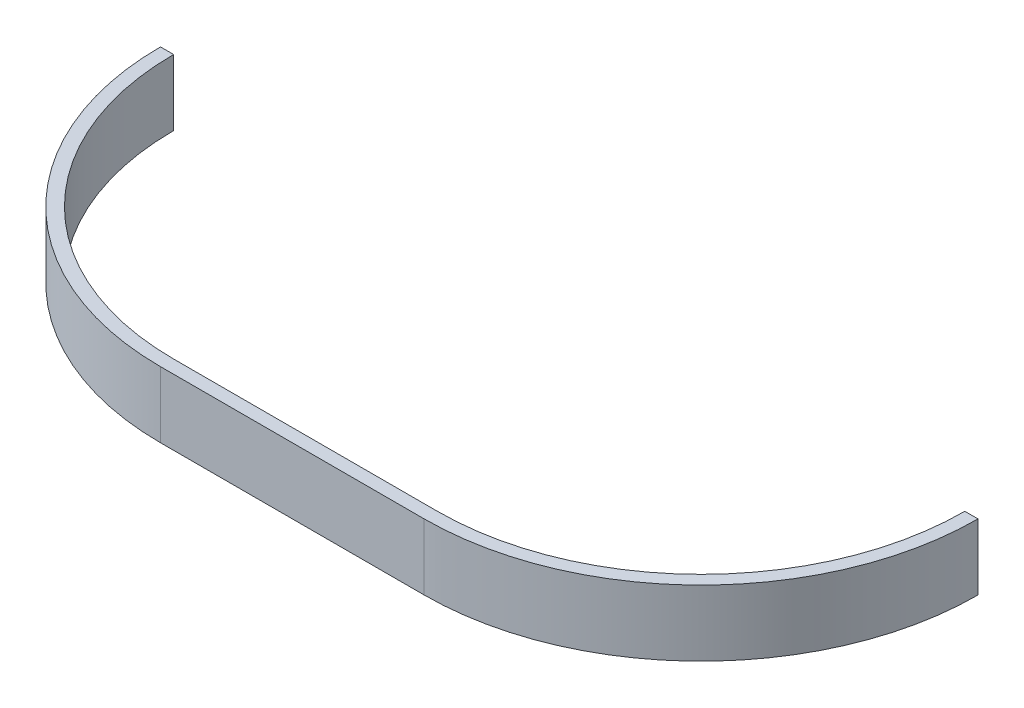
ISO-10303-21;
HEADER;
FILE_DESCRIPTION(('STEP AP214'),'2;1');
FILE_NAME('part.step','',(''),(''),'','','');
FILE_SCHEMA(('AUTOMOTIVE_DESIGN { 1 0 10303 214 1 1 1 1 }'));
ENDSEC;
DATA;
#1=APPLICATION_CONTEXT('core data for automotive mechanical design processes');
#2=APPLICATION_PROTOCOL_DEFINITION('international standard','automotive_design',2000,#1);
#3=PRODUCT_CONTEXT('',#1,'mechanical');
#4=PRODUCT('Part','Part','',(#3));
#5=PRODUCT_RELATED_PRODUCT_CATEGORY('part','',(#4));
#6=PRODUCT_DEFINITION_FORMATION('','',#4);
#7=PRODUCT_DEFINITION_CONTEXT('part definition',#1,'design');
#8=PRODUCT_DEFINITION('design','',#6,#7);
#9=PRODUCT_DEFINITION_SHAPE('','',#8);
#10=(LENGTH_UNIT() NAMED_UNIT(*) SI_UNIT(.MILLI.,.METRE.));
#11=(NAMED_UNIT(*) PLANE_ANGLE_UNIT() SI_UNIT($,.RADIAN.));
#12=(NAMED_UNIT(*) SI_UNIT($,.STERADIAN.) SOLID_ANGLE_UNIT());
#13=UNCERTAINTY_MEASURE_WITH_UNIT(LENGTH_MEASURE(1.E-05),#10,'distance_accuracy_value','');
#14=(GEOMETRIC_REPRESENTATION_CONTEXT(3) GLOBAL_UNCERTAINTY_ASSIGNED_CONTEXT((#13)) GLOBAL_UNIT_ASSIGNED_CONTEXT((#10,
#11,#12)) REPRESENTATION_CONTEXT('',''));
#15=CARTESIAN_POINT('',(0.,0.,0.));
#16=DIRECTION('',(0.,0.,1.));
#17=DIRECTION('',(1.,0.,0.));
#18=AXIS2_PLACEMENT_3D('',#15,#16,#17);
#19=CARTESIAN_POINT('',(40.,20.,0.));
#20=DIRECTION('',(0.,-1.,0.));
#21=DIRECTION('',(0.,0.,-1.));
#22=AXIS2_PLACEMENT_3D('',#19,#20,#21);
#23=CYLINDRICAL_SURFACE('',#22,80.);
#24=CARTESIAN_POINT('',(40.,0.,0.));
#25=DIRECTION('',(0.,-1.,0.));
#26=DIRECTION('',(0.,0.,1.));
#27=AXIS2_PLACEMENT_3D('',#24,#25,#26);
#28=CIRCLE('',#27,80.);
#29=CARTESIAN_POINT('',(120.,0.,0.));
#30=VERTEX_POINT('',#29);
#31=CARTESIAN_POINT('',(40.,0.,80.));
#32=VERTEX_POINT('',#31);
#33=EDGE_CURVE('E132',#30,#32,#28,.T.);
#34=ORIENTED_EDGE('',*,*,#33,.T.);
#35=DIRECTION('',(0.,-1.,0.));
#36=VECTOR('',#35,1.);
#37=CARTESIAN_POINT('',(40.,20.,80.));
#38=LINE('',#37,#36);
#39=CARTESIAN_POINT('',(40.,20.,80.));
#40=VERTEX_POINT('',#39);
#41=EDGE_CURVE('E11',#40,#32,#38,.T.);
#42=ORIENTED_EDGE('',*,*,#41,.F.);
#43=CARTESIAN_POINT('',(40.,20.,0.));
#44=DIRECTION('',(0.,-1.,0.));
#45=DIRECTION('',(0.,0.,1.));
#46=AXIS2_PLACEMENT_3D('',#43,#44,#45);
#47=CIRCLE('',#46,80.);
#48=CARTESIAN_POINT('',(120.,20.,0.));
#49=VERTEX_POINT('',#48);
#50=EDGE_CURVE('E146',#49,#40,#47,.T.);
#51=ORIENTED_EDGE('',*,*,#50,.F.);
#52=DIRECTION('',(0.,-1.,0.));
#53=VECTOR('',#52,1.);
#54=CARTESIAN_POINT('',(120.,20.,0.));
#55=LINE('',#54,#53);
#56=EDGE_CURVE('E128',#49,#30,#55,.T.);
#57=ORIENTED_EDGE('',*,*,#56,.T.);
#58=EDGE_LOOP('',(#34,#42,#51,#57));
#59=FACE_BOUND('',#58,.T.);
#60=ADVANCED_FACE('F36',(#59),#23,.F.);
#61=CARTESIAN_POINT('',(-40.,20.,80.));
#62=DIRECTION('',(0.,0.,1.));
#63=DIRECTION('',(1.,0.,0.));
#64=AXIS2_PLACEMENT_3D('',#61,#62,#63);
#65=PLANE('',#64);
#66=DIRECTION('',(-1.,0.,0.));
#67=VECTOR('',#66,1.);
#68=CARTESIAN_POINT('',(-40.,0.,80.));
#69=LINE('',#68,#67);
#70=CARTESIAN_POINT('',(-40.,0.,80.));
#71=VERTEX_POINT('',#70);
#72=EDGE_CURVE('E135',#32,#71,#69,.T.);
#73=ORIENTED_EDGE('',*,*,#72,.T.);
#74=DIRECTION('',(0.,-1.,0.));
#75=VECTOR('',#74,1.);
#76=CARTESIAN_POINT('',(-40.,20.,80.));
#77=LINE('',#76,#75);
#78=CARTESIAN_POINT('',(-40.,20.,80.));
#79=VERTEX_POINT('',#78);
#80=EDGE_CURVE('E44',#79,#71,#77,.T.);
#81=ORIENTED_EDGE('',*,*,#80,.F.);
#82=DIRECTION('',(-1.,0.,0.));
#83=VECTOR('',#82,1.);
#84=CARTESIAN_POINT('',(-40.,20.,80.));
#85=LINE('',#84,#83);
#86=EDGE_CURVE('E95',#40,#79,#85,.T.);
#87=ORIENTED_EDGE('',*,*,#86,.F.);
#88=ORIENTED_EDGE('',*,*,#41,.T.);
#89=EDGE_LOOP('',(#73,#81,#87,#88));
#90=FACE_BOUND('',#89,.T.);
#91=ADVANCED_FACE('F181',(#90),#65,.F.);
#92=CARTESIAN_POINT('',(-40.,20.,0.));
#93=DIRECTION('',(0.,-1.,0.));
#94=DIRECTION('',(0.,0.,-1.));
#95=AXIS2_PLACEMENT_3D('',#92,#93,#94);
#96=CYLINDRICAL_SURFACE('',#95,80.);
#97=CARTESIAN_POINT('',(-40.,0.,0.));
#98=DIRECTION('',(0.,-1.,0.));
#99=DIRECTION('',(0.,0.,1.));
#100=AXIS2_PLACEMENT_3D('',#97,#98,#99);
#101=CIRCLE('',#100,80.);
#102=CARTESIAN_POINT('',(-120.,0.,0.));
#103=VERTEX_POINT('',#102);
#104=EDGE_CURVE('E137',#71,#103,#101,.T.);
#105=ORIENTED_EDGE('',*,*,#104,.T.);
#106=DIRECTION('',(0.,-1.,0.));
#107=VECTOR('',#106,1.);
#108=CARTESIAN_POINT('',(-120.,20.,0.));
#109=LINE('',#108,#107);
#110=CARTESIAN_POINT('',(-120.,20.,0.));
#111=VERTEX_POINT('',#110);
#112=EDGE_CURVE('E153',#111,#103,#109,.T.);
#113=ORIENTED_EDGE('',*,*,#112,.F.);
#114=CARTESIAN_POINT('',(-40.,20.,0.));
#115=DIRECTION('',(0.,-1.,0.));
#116=DIRECTION('',(0.,0.,1.));
#117=AXIS2_PLACEMENT_3D('',#114,#115,#116);
#118=CIRCLE('',#117,80.);
#119=EDGE_CURVE('E161',#79,#111,#118,.T.);
#120=ORIENTED_EDGE('',*,*,#119,.F.);
#121=ORIENTED_EDGE('',*,*,#80,.T.);
#122=EDGE_LOOP('',(#105,#113,#120,#121));
#123=FACE_BOUND('',#122,.T.);
#124=ADVANCED_FACE('F159',(#123),#96,.F.);
#125=CARTESIAN_POINT('',(-124.,20.,0.));
#126=DIRECTION('',(0.,0.,1.));
#127=DIRECTION('',(1.,0.,0.));
#128=AXIS2_PLACEMENT_3D('',#125,#126,#127);
#129=PLANE('',#128);
#130=DIRECTION('',(-1.,0.,0.));
#131=VECTOR('',#130,1.);
#132=CARTESIAN_POINT('',(-124.,0.,0.));
#133=LINE('',#132,#131);
#134=CARTESIAN_POINT('',(-124.,0.,0.));
#135=VERTEX_POINT('',#134);
#136=EDGE_CURVE('E139',#103,#135,#133,.T.);
#137=ORIENTED_EDGE('',*,*,#136,.T.);
#138=DIRECTION('',(0.,-1.,0.));
#139=VECTOR('',#138,1.);
#140=CARTESIAN_POINT('',(-124.,20.,0.));
#141=LINE('',#140,#139);
#142=CARTESIAN_POINT('',(-124.,20.,0.));
#143=VERTEX_POINT('',#142);
#144=EDGE_CURVE('E150',#143,#135,#141,.T.);
#145=ORIENTED_EDGE('',*,*,#144,.F.);
#146=DIRECTION('',(-1.,0.,0.));
#147=VECTOR('',#146,1.);
#148=CARTESIAN_POINT('',(-124.,20.,0.));
#149=LINE('',#148,#147);
#150=EDGE_CURVE('E173',#111,#143,#149,.T.);
#151=ORIENTED_EDGE('',*,*,#150,.F.);
#152=ORIENTED_EDGE('',*,*,#112,.T.);
#153=EDGE_LOOP('',(#137,#145,#151,#152));
#154=FACE_BOUND('',#153,.T.);
#155=ADVANCED_FACE('F169',(#154),#129,.F.);
#156=CARTESIAN_POINT('',(-40.,20.,0.));
#157=DIRECTION('',(0.,-1.,0.));
#158=DIRECTION('',(0.,0.,-1.));
#159=AXIS2_PLACEMENT_3D('',#156,#157,#158);
#160=CYLINDRICAL_SURFACE('',#159,84.);
#161=CARTESIAN_POINT('',(-40.,0.,0.));
#162=DIRECTION('',(0.,1.,0.));
#163=DIRECTION('',(0.,0.,1.));
#164=AXIS2_PLACEMENT_3D('',#161,#162,#163);
#165=CIRCLE('',#164,84.);
#166=CARTESIAN_POINT('',(-40.,0.,84.));
#167=VERTEX_POINT('',#166);
#168=EDGE_CURVE('E141',#135,#167,#165,.T.);
#169=ORIENTED_EDGE('',*,*,#168,.T.);
#170=DIRECTION('',(0.,-1.,0.));
#171=VECTOR('',#170,1.);
#172=CARTESIAN_POINT('',(-40.,20.,84.));
#173=LINE('',#172,#171);
#174=CARTESIAN_POINT('',(-40.,20.,84.));
#175=VERTEX_POINT('',#174);
#176=EDGE_CURVE('E123',#175,#167,#173,.T.);
#177=ORIENTED_EDGE('',*,*,#176,.F.);
#178=CARTESIAN_POINT('',(-40.,20.,0.));
#179=DIRECTION('',(0.,1.,0.));
#180=DIRECTION('',(0.,0.,1.));
#181=AXIS2_PLACEMENT_3D('',#178,#179,#180);
#182=CIRCLE('',#181,84.);
#183=EDGE_CURVE('E114',#143,#175,#182,.T.);
#184=ORIENTED_EDGE('',*,*,#183,.F.);
#185=ORIENTED_EDGE('',*,*,#144,.T.);
#186=EDGE_LOOP('',(#169,#177,#184,#185));
#187=FACE_BOUND('',#186,.T.);
#188=ADVANCED_FACE('F172',(#187),#160,.T.);
#189=CARTESIAN_POINT('',(-40.,20.,84.));
#190=DIRECTION('',(0.,0.,-1.));
#191=DIRECTION('',(-1.,0.,0.));
#192=AXIS2_PLACEMENT_3D('',#189,#190,#191);
#193=PLANE('',#192);
#194=DIRECTION('',(1.,0.,0.));
#195=VECTOR('',#194,1.);
#196=CARTESIAN_POINT('',(-40.,0.,84.));
#197=LINE('',#196,#195);
#198=CARTESIAN_POINT('',(40.,0.,84.));
#199=VERTEX_POINT('',#198);
#200=EDGE_CURVE('E122',#167,#199,#197,.T.);
#201=ORIENTED_EDGE('',*,*,#200,.T.);
#202=DIRECTION('',(0.,-1.,0.));
#203=VECTOR('',#202,1.);
#204=CARTESIAN_POINT('',(40.,20.,84.));
#205=LINE('',#204,#203);
#206=CARTESIAN_POINT('',(40.,20.,84.));
#207=VERTEX_POINT('',#206);
#208=EDGE_CURVE('E119',#207,#199,#205,.T.);
#209=ORIENTED_EDGE('',*,*,#208,.F.);
#210=DIRECTION('',(1.,0.,0.));
#211=VECTOR('',#210,1.);
#212=CARTESIAN_POINT('',(-40.,20.,84.));
#213=LINE('',#212,#211);
#214=EDGE_CURVE('E108',#175,#207,#213,.T.);
#215=ORIENTED_EDGE('',*,*,#214,.F.);
#216=ORIENTED_EDGE('',*,*,#176,.T.);
#217=EDGE_LOOP('',(#201,#209,#215,#216));
#218=FACE_BOUND('',#217,.T.);
#219=ADVANCED_FACE('F120',(#218),#193,.F.);
#220=CARTESIAN_POINT('',(40.,20.,0.));
#221=DIRECTION('',(0.,-1.,0.));
#222=DIRECTION('',(0.,0.,-1.));
#223=AXIS2_PLACEMENT_3D('',#220,#221,#222);
#224=CYLINDRICAL_SURFACE('',#223,84.);
#225=CARTESIAN_POINT('',(40.,0.,0.));
#226=DIRECTION('',(0.,1.,0.));
#227=DIRECTION('',(0.,0.,1.));
#228=AXIS2_PLACEMENT_3D('',#225,#226,#227);
#229=CIRCLE('',#228,84.);
#230=CARTESIAN_POINT('',(124.,0.,0.));
#231=VERTEX_POINT('',#230);
#232=EDGE_CURVE('E81',#199,#231,#229,.T.);
#233=ORIENTED_EDGE('',*,*,#232,.T.);
#234=DIRECTION('',(0.,-1.,0.));
#235=VECTOR('',#234,1.);
#236=CARTESIAN_POINT('',(124.,20.,0.));
#237=LINE('',#236,#235);
#238=CARTESIAN_POINT('',(124.,20.,0.));
#239=VERTEX_POINT('',#238);
#240=EDGE_CURVE('E124',#239,#231,#237,.T.);
#241=ORIENTED_EDGE('',*,*,#240,.F.);
#242=CARTESIAN_POINT('',(40.,20.,0.));
#243=DIRECTION('',(0.,1.,0.));
#244=DIRECTION('',(0.,0.,1.));
#245=AXIS2_PLACEMENT_3D('',#242,#243,#244);
#246=CIRCLE('',#245,84.);
#247=EDGE_CURVE('E112',#207,#239,#246,.T.);
#248=ORIENTED_EDGE('',*,*,#247,.F.);
#249=ORIENTED_EDGE('',*,*,#208,.T.);
#250=EDGE_LOOP('',(#233,#241,#248,#249));
#251=FACE_BOUND('',#250,.T.);
#252=ADVANCED_FACE('F126',(#251),#224,.T.);
#253=CARTESIAN_POINT('',(120.,20.,0.));
#254=DIRECTION('',(0.,0.,1.));
#255=DIRECTION('',(1.,0.,0.));
#256=AXIS2_PLACEMENT_3D('',#253,#254,#255);
#257=PLANE('',#256);
#258=DIRECTION('',(-1.,0.,0.));
#259=VECTOR('',#258,1.);
#260=CARTESIAN_POINT('',(120.,0.,0.));
#261=LINE('',#260,#259);
#262=EDGE_CURVE('E87',#231,#30,#261,.T.);
#263=ORIENTED_EDGE('',*,*,#262,.T.);
#264=ORIENTED_EDGE('',*,*,#56,.F.);
#265=DIRECTION('',(-1.,0.,0.));
#266=VECTOR('',#265,1.);
#267=CARTESIAN_POINT('',(120.,20.,0.));
#268=LINE('',#267,#266);
#269=EDGE_CURVE('E52',#239,#49,#268,.T.);
#270=ORIENTED_EDGE('',*,*,#269,.F.);
#271=ORIENTED_EDGE('',*,*,#240,.T.);
#272=EDGE_LOOP('',(#263,#264,#270,#271));
#273=FACE_BOUND('',#272,.T.);
#274=ADVANCED_FACE('F197',(#273),#257,.F.);
#275=CARTESIAN_POINT('',(40.,20.,0.));
#276=DIRECTION('',(0.,1.,0.));
#277=DIRECTION('',(0.,0.,1.));
#278=AXIS2_PLACEMENT_3D('',#275,#276,#277);
#279=PLANE('',#278);
#280=ORIENTED_EDGE('',*,*,#50,.T.);
#281=ORIENTED_EDGE('',*,*,#86,.T.);
#282=ORIENTED_EDGE('',*,*,#119,.T.);
#283=ORIENTED_EDGE('',*,*,#150,.T.);
#284=ORIENTED_EDGE('',*,*,#183,.T.);
#285=ORIENTED_EDGE('',*,*,#214,.T.);
#286=ORIENTED_EDGE('',*,*,#247,.T.);
#287=ORIENTED_EDGE('',*,*,#269,.T.);
#288=EDGE_LOOP('',(#280,#281,#282,#283,#284,#285,#286,#287));
#289=FACE_BOUND('',#288,.T.);
#290=ADVANCED_FACE('F110',(#289),#279,.T.);
#291=CARTESIAN_POINT('',(40.,0.,0.));
#292=DIRECTION('',(0.,1.,0.));
#293=DIRECTION('',(0.,0.,1.));
#294=AXIS2_PLACEMENT_3D('',#291,#292,#293);
#295=PLANE('',#294);
#296=ORIENTED_EDGE('',*,*,#33,.F.);
#297=ORIENTED_EDGE('',*,*,#262,.F.);
#298=ORIENTED_EDGE('',*,*,#232,.F.);
#299=ORIENTED_EDGE('',*,*,#200,.F.);
#300=ORIENTED_EDGE('',*,*,#168,.F.);
#301=ORIENTED_EDGE('',*,*,#136,.F.);
#302=ORIENTED_EDGE('',*,*,#104,.F.);
#303=ORIENTED_EDGE('',*,*,#72,.F.);
#304=EDGE_LOOP('',(#296,#297,#298,#299,#300,#301,#302,#303));
#305=FACE_BOUND('',#304,.T.);
#306=ADVANCED_FACE('F165',(#305),#295,.F.);
#307=CLOSED_SHELL('',(#60,#91,#124,#155,#188,#219,#252,#274,#290,#306));
#308=MANIFOLD_SOLID_BREP('B2',#307);
#309=ADVANCED_BREP_SHAPE_REPRESENTATION('',(#18,#308),#14);
#310=SHAPE_DEFINITION_REPRESENTATION(#9,#309);
ENDSEC;
END-ISO-10303-21;
